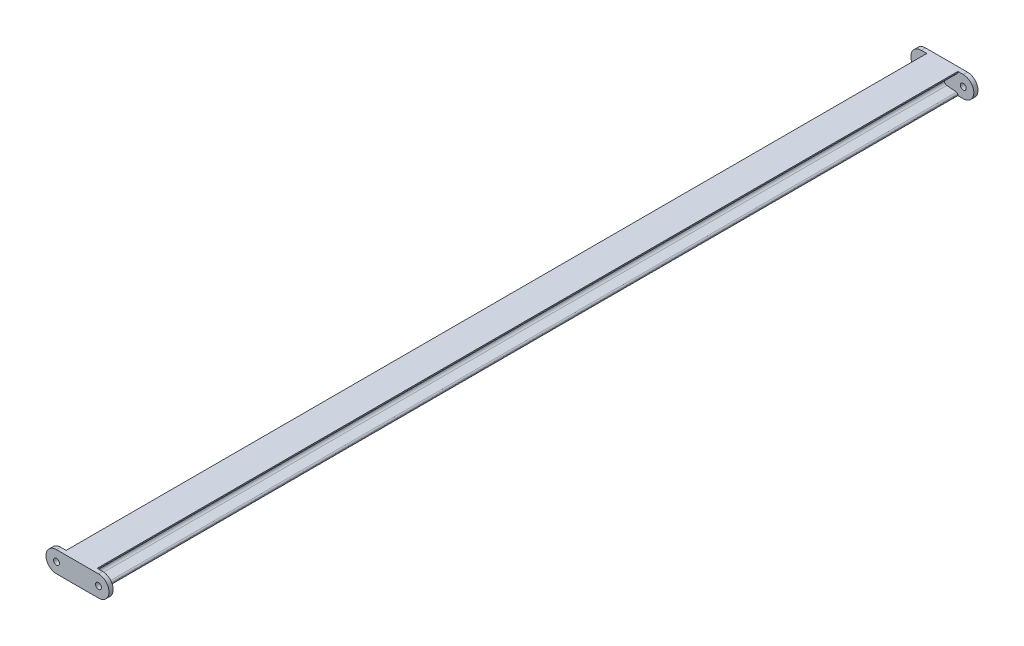
ISO-10303-21;
HEADER;
FILE_DESCRIPTION(('STEP AP214'),'2;1');
FILE_NAME('part.step','',(''),(''),'','','');
FILE_SCHEMA(('AUTOMOTIVE_DESIGN { 1 0 10303 214 1 1 1 1 }'));
ENDSEC;
DATA;
#1=APPLICATION_CONTEXT('core data for automotive mechanical design processes');
#2=APPLICATION_PROTOCOL_DEFINITION('international standard','automotive_design',2000,#1);
#3=PRODUCT_CONTEXT('',#1,'mechanical');
#4=PRODUCT('Part','Part','',(#3));
#5=PRODUCT_RELATED_PRODUCT_CATEGORY('part','',(#4));
#6=PRODUCT_DEFINITION_FORMATION('','',#4);
#7=PRODUCT_DEFINITION_CONTEXT('part definition',#1,'design');
#8=PRODUCT_DEFINITION('design','',#6,#7);
#9=PRODUCT_DEFINITION_SHAPE('','',#8);
#10=(LENGTH_UNIT() NAMED_UNIT(*) SI_UNIT(.MILLI.,.METRE.));
#11=(NAMED_UNIT(*) PLANE_ANGLE_UNIT() SI_UNIT($,.RADIAN.));
#12=(NAMED_UNIT(*) SI_UNIT($,.STERADIAN.) SOLID_ANGLE_UNIT());
#13=UNCERTAINTY_MEASURE_WITH_UNIT(LENGTH_MEASURE(1.E-05),#10,'distance_accuracy_value','');
#14=(GEOMETRIC_REPRESENTATION_CONTEXT(3) GLOBAL_UNCERTAINTY_ASSIGNED_CONTEXT((#13)) GLOBAL_UNIT_ASSIGNED_CONTEXT((#10,
#11,#12)) REPRESENTATION_CONTEXT('',''));
#15=CARTESIAN_POINT('',(0.,0.,0.));
#16=DIRECTION('',(0.,0.,1.));
#17=DIRECTION('',(1.,0.,0.));
#18=AXIS2_PLACEMENT_3D('',#15,#16,#17);
#19=CARTESIAN_POINT('',(49.9999999999998,0.,1025.));
#20=DIRECTION('',(0.,0.,1.));
#21=DIRECTION('',(1.,0.,0.));
#22=AXIS2_PLACEMENT_3D('',#19,#20,#21);
#23=PLANE('',#22);
#24=CARTESIAN_POINT('',(-49.9999999999998,0.,1025.));
#25=DIRECTION('',(0.,0.,1.));
#26=DIRECTION('',(1.,0.,0.));
#27=AXIS2_PLACEMENT_3D('',#24,#25,#26);
#28=CIRCLE('',#27,7.);
#29=CARTESIAN_POINT('',(-42.9999999999998,0.,1025.));
#30=VERTEX_POINT('',#29);
#31=EDGE_CURVE('E342',#30,#30,#28,.T.);
#32=ORIENTED_EDGE('',*,*,#31,.T.);
#33=EDGE_LOOP('',(#32));
#34=FACE_BOUND('',#33,.T.);
#35=DIRECTION('',(0.,1.,0.));
#36=VECTOR('',#35,1.);
#37=CARTESIAN_POINT('',(-37.0000000000004,-24.9999999999996,1025.));
#38=LINE('',#37,#36);
#39=CARTESIAN_POINT('',(-37.0000000000004,-25.0000000000003,1025.));
#40=VERTEX_POINT('',#39);
#41=CARTESIAN_POINT('',(-37.0000000000004,-22.792319515895,1025.));
#42=VERTEX_POINT('',#41);
#43=EDGE_CURVE('E345',#40,#42,#38,.T.);
#44=ORIENTED_EDGE('',*,*,#43,.F.);
#45=DIRECTION('',(-1.,0.,0.));
#46=VECTOR('',#45,1.);
#47=CARTESIAN_POINT('',(-4.44089209850063E-13,-25.,1025.));
#48=LINE('',#47,#46);
#49=CARTESIAN_POINT('',(-49.9999999999998,-25.0000000000004,1025.));
#50=VERTEX_POINT('',#49);
#51=EDGE_CURVE('E450',#40,#50,#48,.T.);
#52=ORIENTED_EDGE('',*,*,#51,.T.);
#53=CARTESIAN_POINT('',(-49.9999999999998,0.,1025.));
#54=DIRECTION('',(0.,0.,1.));
#55=DIRECTION('',(1.,0.,0.));
#56=AXIS2_PLACEMENT_3D('',#53,#54,#55);
#57=CIRCLE('',#56,25.0000000000004);
#58=CARTESIAN_POINT('',(-49.9999999999998,25.0000000000004,1025.));
#59=VERTEX_POINT('',#58);
#60=EDGE_CURVE('E436',#59,#50,#57,.T.);
#61=ORIENTED_EDGE('',*,*,#60,.F.);
#62=DIRECTION('',(1.,0.,0.));
#63=VECTOR('',#62,1.);
#64=CARTESIAN_POINT('',(0.,25.,1025.));
#65=LINE('',#64,#63);
#66=CARTESIAN_POINT('',(-36.9999999999999,24.9999999999997,1025.));
#67=VERTEX_POINT('',#66);
#68=EDGE_CURVE('E445',#59,#67,#65,.T.);
#69=ORIENTED_EDGE('',*,*,#68,.T.);
#70=DIRECTION('',(0.,1.,0.));
#71=VECTOR('',#70,1.);
#72=CARTESIAN_POINT('',(-36.9999999999999,22.7923195158958,1025.));
#73=LINE('',#72,#71);
#74=CARTESIAN_POINT('',(-36.9999999999999,22.7923195158958,1025.));
#75=VERTEX_POINT('',#74);
#76=EDGE_CURVE('E358',#75,#67,#73,.T.);
#77=ORIENTED_EDGE('',*,*,#76,.F.);
#78=CARTESIAN_POINT('',(-33.4999999999996,22.7923195158958,1025.));
#79=DIRECTION('',(0.,0.,-1.));
#80=DIRECTION('',(-1.,0.,0.));
#81=AXIS2_PLACEMENT_3D('',#78,#79,#80);
#82=CIRCLE('',#81,3.5);
#83=CARTESIAN_POINT('',(-33.8482269636629,19.3096857450582,1025.));
#84=VERTEX_POINT('',#83);
#85=EDGE_CURVE('E398',#84,#75,#82,.T.);
#86=ORIENTED_EDGE('',*,*,#85,.F.);
#87=DIRECTION('',(-0.995038220239298,0.0994934181893957,0.));
#88=VECTOR('',#87,1.);
#89=CARTESIAN_POINT('',(-10.8035460726743,17.0054586045401,1025.));
#90=LINE('',#89,#88);
#91=CARTESIAN_POINT('',(-10.8035460726743,17.0054586045401,1025.));
#92=VERTEX_POINT('',#91);
#93=EDGE_CURVE('E395',#92,#84,#90,.T.);
#94=ORIENTED_EDGE('',*,*,#93,.F.);
#95=CARTESIAN_POINT('',(-11.4999999999998,10.040191062865,1025.));
#96=DIRECTION('',(0.,0.,1.));
#97=DIRECTION('',(1.,0.,0.));
#98=AXIS2_PLACEMENT_3D('',#95,#96,#97);
#99=CIRCLE('',#98,7.);
#100=CARTESIAN_POINT('',(-4.49999999999973,10.040191062865,1025.));
#101=VERTEX_POINT('',#100);
#102=EDGE_CURVE('E392',#101,#92,#99,.T.);
#103=ORIENTED_EDGE('',*,*,#102,.F.);
#104=DIRECTION('',(0.,1.,0.));
#105=VECTOR('',#104,1.);
#106=CARTESIAN_POINT('',(-4.50000000000017,-10.0401910628648,1025.));
#107=LINE('',#106,#105);
#108=CARTESIAN_POINT('',(-4.50000000000017,-10.0401910628647,1025.));
#109=VERTEX_POINT('',#108);
#110=EDGE_CURVE('E389',#109,#101,#107,.T.);
#111=ORIENTED_EDGE('',*,*,#110,.F.);
#112=CARTESIAN_POINT('',(-11.5000000000003,-10.0401910628647,1025.));
#113=DIRECTION('',(0.,0.,1.));
#114=DIRECTION('',(1.,0.,0.));
#115=AXIS2_PLACEMENT_3D('',#112,#113,#114);
#116=CIRCLE('',#115,7.);
#117=CARTESIAN_POINT('',(-10.8035460726743,-17.0054586045399,1025.));
#118=VERTEX_POINT('',#117);
#119=EDGE_CURVE('E386',#118,#109,#116,.T.);
#120=ORIENTED_EDGE('',*,*,#119,.F.);
#121=DIRECTION('',(0.9950382202393,0.0994934181893747,0.));
#122=VECTOR('',#121,1.);
#123=CARTESIAN_POINT('',(-33.8482269636629,-19.3096857450575,1025.));
#124=LINE('',#123,#122);
#125=CARTESIAN_POINT('',(-33.8482269636629,-19.3096857450575,1025.));
#126=VERTEX_POINT('',#125);
#127=EDGE_CURVE('E132',#126,#118,#124,.T.);
#128=ORIENTED_EDGE('',*,*,#127,.F.);
#129=CARTESIAN_POINT('',(-33.5000000000001,-22.7923195158951,1025.));
#130=DIRECTION('',(0.,0.,-1.));
#131=DIRECTION('',(-1.,0.,0.));
#132=AXIS2_PLACEMENT_3D('',#129,#130,#131);
#133=CIRCLE('',#132,3.5);
#134=EDGE_CURVE('E127',#42,#126,#133,.T.);
#135=ORIENTED_EDGE('',*,*,#134,.F.);
#136=EDGE_LOOP('',(#44,#52,#61,#69,#77,#86,#94,#103,#111,#120,#128,#135));
#137=FACE_BOUND('',#136,.T.);
#138=ADVANCED_FACE('F112',(#34,#137),#23,.F.);
#139=CARTESIAN_POINT('',(0.,25.,-1025.));
#140=DIRECTION('',(0.,-1.,0.));
#141=DIRECTION('',(1.,0.,0.));
#142=AXIS2_PLACEMENT_3D('',#139,#140,#141);
#143=PLANE('',#142);
#144=DIRECTION('',(0.,0.,1.));
#145=VECTOR('',#144,1.);
#146=CARTESIAN_POINT('',(36.9999999999999,24.9999999999999,-1025.));
#147=LINE('',#146,#145);
#148=CARTESIAN_POINT('',(36.9999999999999,24.9999999999999,-1025.));
#149=VERTEX_POINT('',#148);
#150=CARTESIAN_POINT('',(36.9999999999999,25.0000000000003,1025.));
#151=VERTEX_POINT('',#150);
#152=EDGE_CURVE('E13',#149,#151,#147,.T.);
#153=ORIENTED_EDGE('',*,*,#152,.F.);
#154=DIRECTION('',(1.,0.,0.));
#155=VECTOR('',#154,1.);
#156=CARTESIAN_POINT('',(0.,25.,-1025.));
#157=LINE('',#156,#155);
#158=CARTESIAN_POINT('',(49.9999999999998,25.0000000000004,-1025.));
#159=VERTEX_POINT('',#158);
#160=EDGE_CURVE('E335',#149,#159,#157,.T.);
#161=ORIENTED_EDGE('',*,*,#160,.T.);
#162=DIRECTION('',(0.,0.,1.));
#163=VECTOR('',#162,1.);
#164=CARTESIAN_POINT('',(49.9999999999998,25.0000000000004,-1035.));
#165=LINE('',#164,#163);
#166=CARTESIAN_POINT('',(49.9999999999998,25.0000000000004,-1035.));
#167=VERTEX_POINT('',#166);
#168=EDGE_CURVE('E312',#167,#159,#165,.T.);
#169=ORIENTED_EDGE('',*,*,#168,.F.);
#170=DIRECTION('',(1.,0.,0.));
#171=VECTOR('',#170,1.);
#172=CARTESIAN_POINT('',(-49.9999999999998,25.0000000000004,-1035.));
#173=LINE('',#172,#171);
#174=CARTESIAN_POINT('',(-49.9999999999998,25.0000000000004,-1035.));
#175=VERTEX_POINT('',#174);
#176=EDGE_CURVE('E310',#175,#167,#173,.T.);
#177=ORIENTED_EDGE('',*,*,#176,.F.);
#178=DIRECTION('',(0.,0.,1.));
#179=VECTOR('',#178,1.);
#180=CARTESIAN_POINT('',(-49.9999999999998,25.0000000000004,-1035.));
#181=LINE('',#180,#179);
#182=CARTESIAN_POINT('',(-49.9999999999998,25.0000000000004,-1025.));
#183=VERTEX_POINT('',#182);
#184=EDGE_CURVE('E296',#175,#183,#181,.T.);
#185=ORIENTED_EDGE('',*,*,#184,.T.);
#186=CARTESIAN_POINT('',(-36.9999999999999,25.0000000000004,-1025.));
#187=VERTEX_POINT('',#186);
#188=EDGE_CURVE('E316',#183,#187,#157,.T.);
#189=ORIENTED_EDGE('',*,*,#188,.T.);
#190=DIRECTION('',(0.,0.,1.));
#191=VECTOR('',#190,1.);
#192=CARTESIAN_POINT('',(-36.9999999999999,25.0000000000004,-1025.));
#193=LINE('',#192,#191);
#194=EDGE_CURVE('E382',#187,#67,#193,.T.);
#195=ORIENTED_EDGE('',*,*,#194,.T.);
#196=ORIENTED_EDGE('',*,*,#68,.F.);
#197=DIRECTION('',(0.,0.,-1.));
#198=VECTOR('',#197,1.);
#199=CARTESIAN_POINT('',(-49.9999999999998,25.0000000000004,1035.));
#200=LINE('',#199,#198);
#201=CARTESIAN_POINT('',(-49.9999999999998,25.0000000000004,1035.));
#202=VERTEX_POINT('',#201);
#203=EDGE_CURVE('E455',#202,#59,#200,.T.);
#204=ORIENTED_EDGE('',*,*,#203,.F.);
#205=DIRECTION('',(1.,0.,0.));
#206=VECTOR('',#205,1.);
#207=CARTESIAN_POINT('',(-49.9999999999998,25.0000000000004,1035.));
#208=LINE('',#207,#206);
#209=CARTESIAN_POINT('',(49.9999999999998,25.0000000000004,1035.));
#210=VERTEX_POINT('',#209);
#211=EDGE_CURVE('E433',#202,#210,#208,.T.);
#212=ORIENTED_EDGE('',*,*,#211,.T.);
#213=DIRECTION('',(0.,0.,-1.));
#214=VECTOR('',#213,1.);
#215=CARTESIAN_POINT('',(49.9999999999998,25.0000000000004,1035.));
#216=LINE('',#215,#214);
#217=CARTESIAN_POINT('',(49.9999999999998,25.0000000000004,1025.));
#218=VERTEX_POINT('',#217);
#219=EDGE_CURVE('E444',#210,#218,#216,.T.);
#220=ORIENTED_EDGE('',*,*,#219,.T.);
#221=EDGE_CURVE('E432',#151,#218,#65,.T.);
#222=ORIENTED_EDGE('',*,*,#221,.F.);
#223=EDGE_LOOP('',(#153,#161,#169,#177,#185,#189,#195,#196,#204,#212,#220,#222));
#224=FACE_BOUND('',#223,.T.);
#225=ADVANCED_FACE('F114',(#224),#143,.F.);
#226=CARTESIAN_POINT('',(36.9999999999999,24.9999999999999,-1025.));
#227=DIRECTION('',(-1.,0.,0.));
#228=DIRECTION('',(0.,-1.,0.));
#229=AXIS2_PLACEMENT_3D('',#226,#227,#228);
#230=PLANE('',#229);
#231=DIRECTION('',(0.,-1.,0.));
#232=VECTOR('',#231,1.);
#233=CARTESIAN_POINT('',(36.9999999999999,24.9999999999999,1025.));
#234=LINE('',#233,#232);
#235=CARTESIAN_POINT('',(36.9999999999999,22.7923195158953,1025.));
#236=VERTEX_POINT('',#235);
#237=EDGE_CURVE('E458',#151,#236,#234,.T.);
#238=ORIENTED_EDGE('',*,*,#237,.T.);
#239=DIRECTION('',(0.,0.,1.));
#240=VECTOR('',#239,1.);
#241=CARTESIAN_POINT('',(36.9999999999999,22.7923195158953,-1025.));
#242=LINE('',#241,#240);
#243=CARTESIAN_POINT('',(36.9999999999999,22.7923195158953,-1025.));
#244=VERTEX_POINT('',#243);
#245=EDGE_CURVE('E120',#244,#236,#242,.T.);
#246=ORIENTED_EDGE('',*,*,#245,.F.);
#247=DIRECTION('',(0.,-1.,0.));
#248=VECTOR('',#247,1.);
#249=CARTESIAN_POINT('',(36.9999999999999,24.9999999999999,-1025.));
#250=LINE('',#249,#248);
#251=EDGE_CURVE('E467',#149,#244,#250,.T.);
#252=ORIENTED_EDGE('',*,*,#251,.F.);
#253=ORIENTED_EDGE('',*,*,#152,.T.);
#254=EDGE_LOOP('',(#238,#246,#252,#253));
#255=FACE_BOUND('',#254,.T.);
#256=ADVANCED_FACE('F549',(#255),#230,.F.);
#257=CARTESIAN_POINT('',(33.5000000000001,22.7923195158953,-1025.));
#258=DIRECTION('',(0.,0.,1.));
#259=DIRECTION('',(1.,0.,0.));
#260=AXIS2_PLACEMENT_3D('',#257,#258,#259);
#261=CYLINDRICAL_SURFACE('',#260,3.5);
#262=CARTESIAN_POINT('',(33.5000000000001,22.7923195158953,1025.));
#263=DIRECTION('',(0.,0.,-1.));
#264=DIRECTION('',(-1.,0.,0.));
#265=AXIS2_PLACEMENT_3D('',#262,#263,#264);
#266=CIRCLE('',#265,3.5);
#267=CARTESIAN_POINT('',(33.8482269636629,19.3096857450578,1025.));
#268=VERTEX_POINT('',#267);
#269=EDGE_CURVE('E498',#236,#268,#266,.T.);
#270=ORIENTED_EDGE('',*,*,#269,.T.);
#271=DIRECTION('',(0.,0.,1.));
#272=VECTOR('',#271,1.);
#273=CARTESIAN_POINT('',(33.8482269636629,19.3096857450578,-1025.));
#274=LINE('',#273,#272);
#275=CARTESIAN_POINT('',(33.8482269636629,19.3096857450578,-1025.));
#276=VERTEX_POINT('',#275);
#277=EDGE_CURVE('E541',#276,#268,#274,.T.);
#278=ORIENTED_EDGE('',*,*,#277,.F.);
#279=CARTESIAN_POINT('',(33.5000000000001,22.7923195158953,-1025.));
#280=DIRECTION('',(0.,0.,-1.));
#281=DIRECTION('',(-1.,0.,0.));
#282=AXIS2_PLACEMENT_3D('',#279,#280,#281);
#283=CIRCLE('',#282,3.5);
#284=EDGE_CURVE('E470',#244,#276,#283,.T.);
#285=ORIENTED_EDGE('',*,*,#284,.F.);
#286=ORIENTED_EDGE('',*,*,#245,.T.);
#287=EDGE_LOOP('',(#270,#278,#285,#286));
#288=FACE_BOUND('',#287,.T.);
#289=ADVANCED_FACE('F546',(#288),#261,.T.);
#290=CARTESIAN_POINT('',(33.8482269636629,19.3096857450578,-1025.));
#291=DIRECTION('',(-0.0994934181893816,0.995038220239299,0.));
#292=DIRECTION('',(-0.9950382202393,-0.0994934181893816,0.));
#293=AXIS2_PLACEMENT_3D('',#290,#291,#292);
#294=PLANE('',#293);
#295=DIRECTION('',(-0.9950382202393,-0.0994934181893816,0.));
#296=VECTOR('',#295,1.);
#297=CARTESIAN_POINT('',(33.8482269636629,19.3096857450578,1025.));
#298=LINE('',#297,#296);
#299=CARTESIAN_POINT('',(10.8035460726743,17.0054586045399,1025.));
#300=VERTEX_POINT('',#299);
#301=EDGE_CURVE('E501',#268,#300,#298,.T.);
#302=ORIENTED_EDGE('',*,*,#301,.T.);
#303=DIRECTION('',(0.,0.,1.));
#304=VECTOR('',#303,1.);
#305=CARTESIAN_POINT('',(10.8035460726743,17.0054586045399,-1025.));
#306=LINE('',#305,#304);
#307=CARTESIAN_POINT('',(10.8035460726743,17.0054586045399,-1025.));
#308=VERTEX_POINT('',#307);
#309=EDGE_CURVE('E538',#308,#300,#306,.T.);
#310=ORIENTED_EDGE('',*,*,#309,.F.);
#311=DIRECTION('',(-0.9950382202393,-0.0994934181893816,0.));
#312=VECTOR('',#311,1.);
#313=CARTESIAN_POINT('',(33.8482269636629,19.3096857450578,-1025.));
#314=LINE('',#313,#312);
#315=EDGE_CURVE('E474',#276,#308,#314,.T.);
#316=ORIENTED_EDGE('',*,*,#315,.F.);
#317=ORIENTED_EDGE('',*,*,#277,.T.);
#318=EDGE_LOOP('',(#302,#310,#316,#317));
#319=FACE_BOUND('',#318,.T.);
#320=ADVANCED_FACE('F903',(#319),#294,.F.);
#321=CARTESIAN_POINT('',(11.4999999999998,10.0401910628648,-1025.));
#322=DIRECTION('',(0.,0.,1.));
#323=DIRECTION('',(1.,0.,0.));
#324=AXIS2_PLACEMENT_3D('',#321,#322,#323);
#325=CYLINDRICAL_SURFACE('',#324,7.);
#326=CARTESIAN_POINT('',(11.4999999999998,10.0401910628648,1025.));
#327=DIRECTION('',(0.,0.,1.));
#328=DIRECTION('',(1.,0.,0.));
#329=AXIS2_PLACEMENT_3D('',#326,#327,#328);
#330=CIRCLE('',#329,7.);
#331=CARTESIAN_POINT('',(4.50000000000017,10.0401910628649,1025.));
#332=VERTEX_POINT('',#331);
#333=EDGE_CURVE('E504',#300,#332,#330,.T.);
#334=ORIENTED_EDGE('',*,*,#333,.T.);
#335=DIRECTION('',(0.,0.,1.));
#336=VECTOR('',#335,1.);
#337=CARTESIAN_POINT('',(4.50000000000017,10.0401910628649,-1025.));
#338=LINE('',#337,#336);
#339=CARTESIAN_POINT('',(4.50000000000017,10.0401910628649,-1025.));
#340=VERTEX_POINT('',#339);
#341=EDGE_CURVE('E535',#340,#332,#338,.T.);
#342=ORIENTED_EDGE('',*,*,#341,.F.);
#343=CARTESIAN_POINT('',(11.4999999999998,10.0401910628648,-1025.));
#344=DIRECTION('',(0.,0.,1.));
#345=DIRECTION('',(1.,0.,0.));
#346=AXIS2_PLACEMENT_3D('',#343,#344,#345);
#347=CIRCLE('',#346,7.);
#348=EDGE_CURVE('E477',#308,#340,#347,.T.);
#349=ORIENTED_EDGE('',*,*,#348,.F.);
#350=ORIENTED_EDGE('',*,*,#309,.T.);
#351=EDGE_LOOP('',(#334,#342,#349,#350));
#352=FACE_BOUND('',#351,.T.);
#353=ADVANCED_FACE('F892',(#352),#325,.F.);
#354=CARTESIAN_POINT('',(4.50000000000017,10.0401910628649,-1025.));
#355=DIRECTION('',(-1.,0.,0.));
#356=DIRECTION('',(0.,-1.,0.));
#357=AXIS2_PLACEMENT_3D('',#354,#355,#356);
#358=PLANE('',#357);
#359=DIRECTION('',(0.,-1.,0.));
#360=VECTOR('',#359,1.);
#361=CARTESIAN_POINT('',(4.50000000000017,10.0401910628649,1025.));
#362=LINE('',#361,#360);
#363=CARTESIAN_POINT('',(4.50000000000017,-10.0401910628649,1025.));
#364=VERTEX_POINT('',#363);
#365=EDGE_CURVE('E507',#332,#364,#362,.T.);
#366=ORIENTED_EDGE('',*,*,#365,.T.);
#367=DIRECTION('',(0.,0.,1.));
#368=VECTOR('',#367,1.);
#369=CARTESIAN_POINT('',(4.50000000000017,-10.0401910628649,-1025.));
#370=LINE('',#369,#368);
#371=CARTESIAN_POINT('',(4.50000000000017,-10.0401910628649,-1025.));
#372=VERTEX_POINT('',#371);
#373=EDGE_CURVE('E532',#372,#364,#370,.T.);
#374=ORIENTED_EDGE('',*,*,#373,.F.);
#375=DIRECTION('',(0.,-1.,0.));
#376=VECTOR('',#375,1.);
#377=CARTESIAN_POINT('',(4.50000000000017,10.0401910628649,-1025.));
#378=LINE('',#377,#376);
#379=EDGE_CURVE('E480',#340,#372,#378,.T.);
#380=ORIENTED_EDGE('',*,*,#379,.F.);
#381=ORIENTED_EDGE('',*,*,#341,.T.);
#382=EDGE_LOOP('',(#366,#374,#380,#381));
#383=FACE_BOUND('',#382,.T.);
#384=ADVANCED_FACE('F881',(#383),#358,.F.);
#385=CARTESIAN_POINT('',(11.4999999999998,-10.0401910628649,-1025.));
#386=DIRECTION('',(0.,0.,1.));
#387=DIRECTION('',(1.,0.,0.));
#388=AXIS2_PLACEMENT_3D('',#385,#386,#387);
#389=CYLINDRICAL_SURFACE('',#388,7.);
#390=CARTESIAN_POINT('',(11.4999999999998,-10.0401910628649,1025.));
#391=DIRECTION('',(0.,0.,1.));
#392=DIRECTION('',(1.,0.,0.));
#393=AXIS2_PLACEMENT_3D('',#390,#391,#392);
#394=CIRCLE('',#393,7.);
#395=CARTESIAN_POINT('',(10.8035460726743,-17.00545860454,1025.));
#396=VERTEX_POINT('',#395);
#397=EDGE_CURVE('E510',#364,#396,#394,.T.);
#398=ORIENTED_EDGE('',*,*,#397,.T.);
#399=DIRECTION('',(0.,0.,1.));
#400=VECTOR('',#399,1.);
#401=CARTESIAN_POINT('',(10.8035460726743,-17.00545860454,-1025.));
#402=LINE('',#401,#400);
#403=CARTESIAN_POINT('',(10.8035460726743,-17.00545860454,-1025.));
#404=VERTEX_POINT('',#403);
#405=EDGE_CURVE('E529',#404,#396,#402,.T.);
#406=ORIENTED_EDGE('',*,*,#405,.F.);
#407=CARTESIAN_POINT('',(11.4999999999998,-10.0401910628649,-1025.));
#408=DIRECTION('',(0.,0.,1.));
#409=DIRECTION('',(1.,0.,0.));
#410=AXIS2_PLACEMENT_3D('',#407,#408,#409);
#411=CIRCLE('',#410,7.);
#412=EDGE_CURVE('E483',#372,#404,#411,.T.);
#413=ORIENTED_EDGE('',*,*,#412,.F.);
#414=ORIENTED_EDGE('',*,*,#373,.T.);
#415=EDGE_LOOP('',(#398,#406,#413,#414));
#416=FACE_BOUND('',#415,.T.);
#417=ADVANCED_FACE('F870',(#416),#389,.F.);
#418=CARTESIAN_POINT('',(10.8035460726743,-17.00545860454,-1025.));
#419=DIRECTION('',(-0.0994934181893889,-0.995038220239299,0.));
#420=DIRECTION('',(0.995038220239299,-0.0994934181893889,0.));
#421=AXIS2_PLACEMENT_3D('',#418,#419,#420);
#422=PLANE('',#421);
#423=DIRECTION('',(0.995038220239299,-0.0994934181893889,0.));
#424=VECTOR('',#423,1.);
#425=CARTESIAN_POINT('',(10.8035460726743,-17.00545860454,1025.));
#426=LINE('',#425,#424);
#427=CARTESIAN_POINT('',(33.8482269636629,-19.309685745058,1025.));
#428=VERTEX_POINT('',#427);
#429=EDGE_CURVE('E513',#396,#428,#426,.T.);
#430=ORIENTED_EDGE('',*,*,#429,.T.);
#431=DIRECTION('',(0.,0.,1.));
#432=VECTOR('',#431,1.);
#433=CARTESIAN_POINT('',(33.8482269636629,-19.309685745058,-1025.));
#434=LINE('',#433,#432);
#435=CARTESIAN_POINT('',(33.8482269636629,-19.309685745058,-1025.));
#436=VERTEX_POINT('',#435);
#437=EDGE_CURVE('E526',#436,#428,#434,.T.);
#438=ORIENTED_EDGE('',*,*,#437,.F.);
#439=DIRECTION('',(0.995038220239299,-0.0994934181893889,0.));
#440=VECTOR('',#439,1.);
#441=CARTESIAN_POINT('',(10.8035460726743,-17.00545860454,-1025.));
#442=LINE('',#441,#440);
#443=EDGE_CURVE('E486',#404,#436,#442,.T.);
#444=ORIENTED_EDGE('',*,*,#443,.F.);
#445=ORIENTED_EDGE('',*,*,#405,.T.);
#446=EDGE_LOOP('',(#430,#438,#444,#445));
#447=FACE_BOUND('',#446,.T.);
#448=ADVANCED_FACE('F859',(#447),#422,.F.);
#449=CARTESIAN_POINT('',(33.5000000000001,-22.7923195158956,-1025.));
#450=DIRECTION('',(0.,0.,1.));
#451=DIRECTION('',(1.,0.,0.));
#452=AXIS2_PLACEMENT_3D('',#449,#450,#451);
#453=CYLINDRICAL_SURFACE('',#452,3.5);
#454=CARTESIAN_POINT('',(33.5000000000001,-22.7923195158956,1025.));
#455=DIRECTION('',(0.,0.,-1.));
#456=DIRECTION('',(-1.,0.,0.));
#457=AXIS2_PLACEMENT_3D('',#454,#455,#456);
#458=CIRCLE('',#457,3.5);
#459=CARTESIAN_POINT('',(36.9999999999999,-22.7923195158956,1025.));
#460=VERTEX_POINT('',#459);
#461=EDGE_CURVE('E516',#428,#460,#458,.T.);
#462=ORIENTED_EDGE('',*,*,#461,.T.);
#463=DIRECTION('',(0.,0.,1.));
#464=VECTOR('',#463,1.);
#465=CARTESIAN_POINT('',(36.9999999999999,-22.7923195158956,-1025.));
#466=LINE('',#465,#464);
#467=CARTESIAN_POINT('',(36.9999999999999,-22.7923195158956,-1025.));
#468=VERTEX_POINT('',#467);
#469=EDGE_CURVE('E523',#468,#460,#466,.T.);
#470=ORIENTED_EDGE('',*,*,#469,.F.);
#471=CARTESIAN_POINT('',(33.5000000000001,-22.7923195158956,-1025.));
#472=DIRECTION('',(0.,0.,-1.));
#473=DIRECTION('',(-1.,0.,0.));
#474=AXIS2_PLACEMENT_3D('',#471,#472,#473);
#475=CIRCLE('',#474,3.5);
#476=EDGE_CURVE('E489',#436,#468,#475,.T.);
#477=ORIENTED_EDGE('',*,*,#476,.F.);
#478=ORIENTED_EDGE('',*,*,#437,.T.);
#479=EDGE_LOOP('',(#462,#470,#477,#478));
#480=FACE_BOUND('',#479,.T.);
#481=ADVANCED_FACE('F849',(#480),#453,.T.);
#482=CARTESIAN_POINT('',(36.9999999999999,-22.7923195158956,-1025.));
#483=DIRECTION('',(-1.,0.,0.));
#484=DIRECTION('',(0.,-1.,0.));
#485=AXIS2_PLACEMENT_3D('',#482,#483,#484);
#486=PLANE('',#485);
#487=DIRECTION('',(0.,-1.,0.));
#488=VECTOR('',#487,1.);
#489=CARTESIAN_POINT('',(36.9999999999999,-22.7923195158956,1025.));
#490=LINE('',#489,#488);
#491=CARTESIAN_POINT('',(36.9999999999999,-24.9999999999997,1025.));
#492=VERTEX_POINT('',#491);
#493=EDGE_CURVE('E471',#460,#492,#490,.T.);
#494=ORIENTED_EDGE('',*,*,#493,.T.);
#495=DIRECTION('',(0.,0.,1.));
#496=VECTOR('',#495,1.);
#497=CARTESIAN_POINT('',(36.9999999999999,-25.0000000000002,-1025.));
#498=LINE('',#497,#496);
#499=CARTESIAN_POINT('',(36.9999999999999,-25.0000000000003,-1025.));
#500=VERTEX_POINT('',#499);
#501=EDGE_CURVE('E495',#500,#492,#498,.T.);
#502=ORIENTED_EDGE('',*,*,#501,.F.);
#503=DIRECTION('',(0.,-1.,0.));
#504=VECTOR('',#503,1.);
#505=CARTESIAN_POINT('',(36.9999999999999,-22.7923195158956,-1025.));
#506=LINE('',#505,#504);
#507=EDGE_CURVE('E492',#468,#500,#506,.T.);
#508=ORIENTED_EDGE('',*,*,#507,.F.);
#509=ORIENTED_EDGE('',*,*,#469,.T.);
#510=EDGE_LOOP('',(#494,#502,#508,#509));
#511=FACE_BOUND('',#510,.T.);
#512=ADVANCED_FACE('F562',(#511),#486,.F.);
#513=CARTESIAN_POINT('',(36.9999999999999,-25.0000000000002,-1025.));
#514=DIRECTION('',(0.,1.,0.));
#515=DIRECTION('',(-1.,0.,0.));
#516=AXIS2_PLACEMENT_3D('',#513,#514,#515);
#517=PLANE('',#516);
#518=ORIENTED_EDGE('',*,*,#501,.T.);
#519=CARTESIAN_POINT('',(49.9999999999998,-25.0000000000004,1025.));
#520=VERTEX_POINT('',#519);
#521=EDGE_CURVE('E451',#520,#492,#48,.T.);
#522=ORIENTED_EDGE('',*,*,#521,.F.);
#523=DIRECTION('',(0.,0.,-1.));
#524=VECTOR('',#523,1.);
#525=CARTESIAN_POINT('',(49.9999999999998,-25.0000000000004,1035.));
#526=LINE('',#525,#524);
#527=CARTESIAN_POINT('',(49.9999999999998,-25.0000000000004,1035.));
#528=VERTEX_POINT('',#527);
#529=EDGE_CURVE('E462',#528,#520,#526,.T.);
#530=ORIENTED_EDGE('',*,*,#529,.F.);
#531=DIRECTION('',(-1.,0.,0.));
#532=VECTOR('',#531,1.);
#533=CARTESIAN_POINT('',(49.9999999999998,-25.0000000000004,1035.));
#534=LINE('',#533,#532);
#535=CARTESIAN_POINT('',(-49.9999999999998,-25.0000000000004,1035.));
#536=VERTEX_POINT('',#535);
#537=EDGE_CURVE('E439',#528,#536,#534,.T.);
#538=ORIENTED_EDGE('',*,*,#537,.T.);
#539=DIRECTION('',(0.,0.,-1.));
#540=VECTOR('',#539,1.);
#541=CARTESIAN_POINT('',(-49.9999999999998,-25.0000000000004,1035.));
#542=LINE('',#541,#540);
#543=EDGE_CURVE('E459',#536,#50,#542,.T.);
#544=ORIENTED_EDGE('',*,*,#543,.T.);
#545=ORIENTED_EDGE('',*,*,#51,.F.);
#546=DIRECTION('',(0.,0.,1.));
#547=VECTOR('',#546,1.);
#548=CARTESIAN_POINT('',(-37.0000000000004,-24.9999999999996,-1025.));
#549=LINE('',#548,#547);
#550=CARTESIAN_POINT('',(-37.0000000000004,-24.9999999999996,-1025.));
#551=VERTEX_POINT('',#550);
#552=EDGE_CURVE('E429',#551,#40,#549,.T.);
#553=ORIENTED_EDGE('',*,*,#552,.F.);
#554=DIRECTION('',(-1.,0.,0.));
#555=VECTOR('',#554,1.);
#556=CARTESIAN_POINT('',(49.9999999999998,-25.0000000000004,-1025.));
#557=LINE('',#556,#555);
#558=CARTESIAN_POINT('',(-49.9999999999998,-25.0000000000004,-1025.));
#559=VERTEX_POINT('',#558);
#560=EDGE_CURVE('E327',#551,#559,#557,.T.);
#561=ORIENTED_EDGE('',*,*,#560,.T.);
#562=DIRECTION('',(0.,0.,1.));
#563=VECTOR('',#562,1.);
#564=CARTESIAN_POINT('',(-49.9999999999998,-25.0000000000004,-1035.));
#565=LINE('',#564,#563);
#566=CARTESIAN_POINT('',(-49.9999999999998,-25.0000000000004,-1035.));
#567=VERTEX_POINT('',#566);
#568=EDGE_CURVE('E306',#567,#559,#565,.T.);
#569=ORIENTED_EDGE('',*,*,#568,.F.);
#570=DIRECTION('',(-1.,0.,0.));
#571=VECTOR('',#570,1.);
#572=CARTESIAN_POINT('',(-4.44089209850063E-13,-25.,-1035.));
#573=LINE('',#572,#571);
#574=CARTESIAN_POINT('',(49.9999999999998,-25.0000000000004,-1035.));
#575=VERTEX_POINT('',#574);
#576=EDGE_CURVE('E319',#575,#567,#573,.T.);
#577=ORIENTED_EDGE('',*,*,#576,.F.);
#578=DIRECTION('',(0.,0.,1.));
#579=VECTOR('',#578,1.);
#580=CARTESIAN_POINT('',(49.9999999999998,-25.0000000000004,-1035.));
#581=LINE('',#580,#579);
#582=CARTESIAN_POINT('',(49.9999999999998,-25.0000000000004,-1025.));
#583=VERTEX_POINT('',#582);
#584=EDGE_CURVE('E339',#575,#583,#581,.T.);
#585=ORIENTED_EDGE('',*,*,#584,.T.);
#586=EDGE_CURVE('E329',#583,#500,#557,.T.);
#587=ORIENTED_EDGE('',*,*,#586,.T.);
#588=EDGE_LOOP('',(#518,#522,#530,#538,#544,#545,#553,#561,#569,#577,#585,#587));
#589=FACE_BOUND('',#588,.T.);
#590=ADVANCED_FACE('F564',(#589),#517,.F.);
#591=CARTESIAN_POINT('',(-49.9999999999998,0.,1035.));
#592=DIRECTION('',(0.,0.,-1.));
#593=DIRECTION('',(-1.,0.,0.));
#594=AXIS2_PLACEMENT_3D('',#591,#592,#593);
#595=CYLINDRICAL_SURFACE('',#594,25.0000000000004);
#596=ORIENTED_EDGE('',*,*,#60,.T.);
#597=ORIENTED_EDGE('',*,*,#543,.F.);
#598=CARTESIAN_POINT('',(-49.9999999999998,0.,1035.));
#599=DIRECTION('',(0.,0.,1.));
#600=DIRECTION('',(1.,0.,0.));
#601=AXIS2_PLACEMENT_3D('',#598,#599,#600);
#602=CIRCLE('',#601,25.0000000000004);
#603=EDGE_CURVE('E441',#202,#536,#602,.T.);
#604=ORIENTED_EDGE('',*,*,#603,.F.);
#605=ORIENTED_EDGE('',*,*,#203,.T.);
#606=EDGE_LOOP('',(#596,#597,#604,#605));
#607=FACE_BOUND('',#606,.T.);
#608=ADVANCED_FACE('F619',(#607),#595,.T.);
#609=CARTESIAN_POINT('',(49.9999999999998,0.,1035.));
#610=DIRECTION('',(0.,0.,-1.));
#611=DIRECTION('',(-1.,0.,0.));
#612=AXIS2_PLACEMENT_3D('',#609,#610,#611);
#613=CYLINDRICAL_SURFACE('',#612,25.0000000000004);
#614=CARTESIAN_POINT('',(49.9999999999998,0.,1025.));
#615=DIRECTION('',(0.,0.,1.));
#616=DIRECTION('',(1.,0.,0.));
#617=AXIS2_PLACEMENT_3D('',#614,#615,#616);
#618=CIRCLE('',#617,25.0000000000004);
#619=EDGE_CURVE('E447',#520,#218,#618,.T.);
#620=ORIENTED_EDGE('',*,*,#619,.T.);
#621=ORIENTED_EDGE('',*,*,#219,.F.);
#622=CARTESIAN_POINT('',(49.9999999999998,0.,1035.));
#623=DIRECTION('',(0.,0.,1.));
#624=DIRECTION('',(1.,0.,0.));
#625=AXIS2_PLACEMENT_3D('',#622,#623,#624);
#626=CIRCLE('',#625,25.0000000000004);
#627=EDGE_CURVE('E435',#528,#210,#626,.T.);
#628=ORIENTED_EDGE('',*,*,#627,.F.);
#629=ORIENTED_EDGE('',*,*,#529,.T.);
#630=EDGE_LOOP('',(#620,#621,#628,#629));
#631=FACE_BOUND('',#630,.T.);
#632=ADVANCED_FACE('F559',(#631),#613,.T.);
#633=CARTESIAN_POINT('',(49.9999999999998,0.,1035.));
#634=DIRECTION('',(0.,0.,1.));
#635=DIRECTION('',(1.,0.,0.));
#636=AXIS2_PLACEMENT_3D('',#633,#634,#635);
#637=PLANE('',#636);
#638=CARTESIAN_POINT('',(-49.9999999999998,0.,1035.));
#639=DIRECTION('',(0.,0.,1.));
#640=DIRECTION('',(1.,0.,0.));
#641=AXIS2_PLACEMENT_3D('',#638,#639,#640);
#642=CIRCLE('',#641,7.);
#643=CARTESIAN_POINT('',(-42.9999999999998,0.,1035.));
#644=VERTEX_POINT('',#643);
#645=EDGE_CURVE('E346',#644,#644,#642,.T.);
#646=ORIENTED_EDGE('',*,*,#645,.F.);
#647=EDGE_LOOP('',(#646));
#648=FACE_BOUND('',#647,.T.);
#649=CARTESIAN_POINT('',(49.9999999999998,0.,1035.));
#650=DIRECTION('',(0.,0.,1.));
#651=DIRECTION('',(1.,0.,0.));
#652=AXIS2_PLACEMENT_3D('',#649,#650,#651);
#653=CIRCLE('',#652,7.);
#654=CARTESIAN_POINT('',(56.9999999999998,0.,1035.));
#655=VERTEX_POINT('',#654);
#656=EDGE_CURVE('E338',#655,#655,#653,.T.);
#657=ORIENTED_EDGE('',*,*,#656,.F.);
#658=EDGE_LOOP('',(#657));
#659=FACE_BOUND('',#658,.T.);
#660=ORIENTED_EDGE('',*,*,#211,.F.);
#661=ORIENTED_EDGE('',*,*,#603,.T.);
#662=ORIENTED_EDGE('',*,*,#537,.F.);
#663=ORIENTED_EDGE('',*,*,#627,.T.);
#664=EDGE_LOOP('',(#660,#661,#662,#663));
#665=FACE_BOUND('',#664,.T.);
#666=ADVANCED_FACE('F592',(#648,#659,#665),#637,.T.);
#667=CARTESIAN_POINT('',(49.9999999999998,0.,1025.));
#668=DIRECTION('',(0.,0.,1.));
#669=DIRECTION('',(1.,0.,0.));
#670=AXIS2_PLACEMENT_3D('',#667,#668,#669);
#671=CIRCLE('',#670,7.);
#672=CARTESIAN_POINT('',(56.9999999999998,0.,1025.));
#673=VERTEX_POINT('',#672);
#674=EDGE_CURVE('E349',#673,#673,#671,.T.);
#675=ORIENTED_EDGE('',*,*,#674,.T.);
#676=EDGE_LOOP('',(#675));
#677=FACE_BOUND('',#676,.T.);
#678=ORIENTED_EDGE('',*,*,#493,.F.);
#679=ORIENTED_EDGE('',*,*,#461,.F.);
#680=ORIENTED_EDGE('',*,*,#429,.F.);
#681=ORIENTED_EDGE('',*,*,#397,.F.);
#682=ORIENTED_EDGE('',*,*,#365,.F.);
#683=ORIENTED_EDGE('',*,*,#333,.F.);
#684=ORIENTED_EDGE('',*,*,#301,.F.);
#685=ORIENTED_EDGE('',*,*,#269,.F.);
#686=ORIENTED_EDGE('',*,*,#237,.F.);
#687=ORIENTED_EDGE('',*,*,#221,.T.);
#688=ORIENTED_EDGE('',*,*,#619,.F.);
#689=ORIENTED_EDGE('',*,*,#521,.T.);
#690=EDGE_LOOP('',(#678,#679,#680,#681,#682,#683,#684,#685,#686,#687,#688,#689));
#691=FACE_BOUND('',#690,.T.);
#692=ADVANCED_FACE('F553',(#677,#691),#23,.F.);
#693=CARTESIAN_POINT('',(-37.0000000000004,-24.9999999999996,-1025.));
#694=DIRECTION('',(1.,0.,0.));
#695=DIRECTION('',(0.,1.,0.));
#696=AXIS2_PLACEMENT_3D('',#693,#694,#695);
#697=PLANE('',#696);
#698=ORIENTED_EDGE('',*,*,#43,.T.);
#699=DIRECTION('',(0.,0.,1.));
#700=VECTOR('',#699,1.);
#701=CARTESIAN_POINT('',(-37.0000000000004,-22.792319515895,-1025.));
#702=LINE('',#701,#700);
#703=CARTESIAN_POINT('',(-37.0000000000004,-22.792319515895,-1025.));
#704=VERTEX_POINT('',#703);
#705=EDGE_CURVE('E426',#704,#42,#702,.T.);
#706=ORIENTED_EDGE('',*,*,#705,.F.);
#707=DIRECTION('',(0.,1.,0.));
#708=VECTOR('',#707,1.);
#709=CARTESIAN_POINT('',(-37.0000000000004,-24.9999999999996,-1025.));
#710=LINE('',#709,#708);
#711=EDGE_CURVE('E354',#551,#704,#710,.T.);
#712=ORIENTED_EDGE('',*,*,#711,.F.);
#713=ORIENTED_EDGE('',*,*,#552,.T.);
#714=EDGE_LOOP('',(#698,#706,#712,#713));
#715=FACE_BOUND('',#714,.T.);
#716=ADVANCED_FACE('F591',(#715),#697,.F.);
#717=CARTESIAN_POINT('',(-33.5000000000001,-22.7923195158951,-1025.));
#718=DIRECTION('',(0.,0.,1.));
#719=DIRECTION('',(1.,0.,0.));
#720=AXIS2_PLACEMENT_3D('',#717,#718,#719);
#721=CYLINDRICAL_SURFACE('',#720,3.5);
#722=ORIENTED_EDGE('',*,*,#134,.T.);
#723=DIRECTION('',(0.,0.,1.));
#724=VECTOR('',#723,1.);
#725=CARTESIAN_POINT('',(-33.8482269636629,-19.3096857450575,-1025.));
#726=LINE('',#725,#724);
#727=CARTESIAN_POINT('',(-33.8482269636629,-19.3096857450575,-1025.));
#728=VERTEX_POINT('',#727);
#729=EDGE_CURVE('E423',#728,#126,#726,.T.);
#730=ORIENTED_EDGE('',*,*,#729,.F.);
#731=CARTESIAN_POINT('',(-33.5000000000001,-22.7923195158951,-1025.));
#732=DIRECTION('',(0.,0.,-1.));
#733=DIRECTION('',(-1.,0.,0.));
#734=AXIS2_PLACEMENT_3D('',#731,#732,#733);
#735=CIRCLE('',#734,3.5);
#736=EDGE_CURVE('E357',#704,#728,#735,.T.);
#737=ORIENTED_EDGE('',*,*,#736,.F.);
#738=ORIENTED_EDGE('',*,*,#705,.T.);
#739=EDGE_LOOP('',(#722,#730,#737,#738));
#740=FACE_BOUND('',#739,.T.);
#741=ADVANCED_FACE('F598',(#740),#721,.T.);
#742=CARTESIAN_POINT('',(-33.8482269636629,-19.3096857450575,-1025.));
#743=DIRECTION('',(0.0994934181893747,-0.9950382202393,0.));
#744=DIRECTION('',(0.9950382202393,0.0994934181893747,0.));
#745=AXIS2_PLACEMENT_3D('',#742,#743,#744);
#746=PLANE('',#745);
#747=ORIENTED_EDGE('',*,*,#127,.T.);
#748=DIRECTION('',(0.,0.,1.));
#749=VECTOR('',#748,1.);
#750=CARTESIAN_POINT('',(-10.8035460726743,-17.0054586045399,-1025.));
#751=LINE('',#750,#749);
#752=CARTESIAN_POINT('',(-10.8035460726743,-17.0054586045399,-1025.));
#753=VERTEX_POINT('',#752);
#754=EDGE_CURVE('E420',#753,#118,#751,.T.);
#755=ORIENTED_EDGE('',*,*,#754,.F.);
#756=DIRECTION('',(0.9950382202393,0.0994934181893747,0.));
#757=VECTOR('',#756,1.);
#758=CARTESIAN_POINT('',(-33.8482269636629,-19.3096857450575,-1025.));
#759=LINE('',#758,#757);
#760=EDGE_CURVE('E361',#728,#753,#759,.T.);
#761=ORIENTED_EDGE('',*,*,#760,.F.);
#762=ORIENTED_EDGE('',*,*,#729,.T.);
#763=EDGE_LOOP('',(#747,#755,#761,#762));
#764=FACE_BOUND('',#763,.T.);
#765=ADVANCED_FACE('F644',(#764),#746,.F.);
#766=CARTESIAN_POINT('',(-11.5000000000003,-10.0401910628647,-1025.));
#767=DIRECTION('',(0.,0.,1.));
#768=DIRECTION('',(1.,0.,0.));
#769=AXIS2_PLACEMENT_3D('',#766,#767,#768);
#770=CYLINDRICAL_SURFACE('',#769,7.);
#771=ORIENTED_EDGE('',*,*,#119,.T.);
#772=DIRECTION('',(0.,0.,1.));
#773=VECTOR('',#772,1.);
#774=CARTESIAN_POINT('',(-4.50000000000017,-10.0401910628647,-1025.));
#775=LINE('',#774,#773);
#776=CARTESIAN_POINT('',(-4.50000000000017,-10.0401910628647,-1025.));
#777=VERTEX_POINT('',#776);
#778=EDGE_CURVE('E417',#777,#109,#775,.T.);
#779=ORIENTED_EDGE('',*,*,#778,.F.);
#780=CARTESIAN_POINT('',(-11.5000000000003,-10.0401910628647,-1025.));
#781=DIRECTION('',(0.,0.,1.));
#782=DIRECTION('',(1.,0.,0.));
#783=AXIS2_PLACEMENT_3D('',#780,#781,#782);
#784=CIRCLE('',#783,7.);
#785=EDGE_CURVE('E364',#753,#777,#784,.T.);
#786=ORIENTED_EDGE('',*,*,#785,.F.);
#787=ORIENTED_EDGE('',*,*,#754,.T.);
#788=EDGE_LOOP('',(#771,#779,#786,#787));
#789=FACE_BOUND('',#788,.T.);
#790=ADVANCED_FACE('F641',(#789),#770,.F.);
#791=CARTESIAN_POINT('',(-4.50000000000017,-10.0401910628648,-1025.));
#792=DIRECTION('',(1.,0.,0.));
#793=DIRECTION('',(0.,1.,0.));
#794=AXIS2_PLACEMENT_3D('',#791,#792,#793);
#795=PLANE('',#794);
#796=ORIENTED_EDGE('',*,*,#110,.T.);
#797=DIRECTION('',(0.,0.,1.));
#798=VECTOR('',#797,1.);
#799=CARTESIAN_POINT('',(-4.49999999999973,10.0401910628649,-1025.));
#800=LINE('',#799,#798);
#801=CARTESIAN_POINT('',(-4.49999999999973,10.0401910628649,-1025.));
#802=VERTEX_POINT('',#801);
#803=EDGE_CURVE('E414',#802,#101,#800,.T.);
#804=ORIENTED_EDGE('',*,*,#803,.F.);
#805=DIRECTION('',(0.,1.,0.));
#806=VECTOR('',#805,1.);
#807=CARTESIAN_POINT('',(-4.50000000000017,-10.0401910628648,-1025.));
#808=LINE('',#807,#806);
#809=EDGE_CURVE('E367',#777,#802,#808,.T.);
#810=ORIENTED_EDGE('',*,*,#809,.F.);
#811=ORIENTED_EDGE('',*,*,#778,.T.);
#812=EDGE_LOOP('',(#796,#804,#810,#811));
#813=FACE_BOUND('',#812,.T.);
#814=ADVANCED_FACE('F639',(#813),#795,.F.);
#815=CARTESIAN_POINT('',(-11.4999999999998,10.040191062865,-1025.));
#816=DIRECTION('',(0.,0.,1.));
#817=DIRECTION('',(1.,0.,0.));
#818=AXIS2_PLACEMENT_3D('',#815,#816,#817);
#819=CYLINDRICAL_SURFACE('',#818,7.);
#820=ORIENTED_EDGE('',*,*,#102,.T.);
#821=DIRECTION('',(0.,0.,1.));
#822=VECTOR('',#821,1.);
#823=CARTESIAN_POINT('',(-10.8035460726743,17.0054586045401,-1025.));
#824=LINE('',#823,#822);
#825=CARTESIAN_POINT('',(-10.8035460726743,17.0054586045401,-1025.));
#826=VERTEX_POINT('',#825);
#827=EDGE_CURVE('E411',#826,#92,#824,.T.);
#828=ORIENTED_EDGE('',*,*,#827,.F.);
#829=CARTESIAN_POINT('',(-11.4999999999998,10.040191062865,-1025.));
#830=DIRECTION('',(0.,0.,1.));
#831=DIRECTION('',(1.,0.,0.));
#832=AXIS2_PLACEMENT_3D('',#829,#830,#831);
#833=CIRCLE('',#832,7.);
#834=EDGE_CURVE('E370',#802,#826,#833,.T.);
#835=ORIENTED_EDGE('',*,*,#834,.F.);
#836=ORIENTED_EDGE('',*,*,#803,.T.);
#837=EDGE_LOOP('',(#820,#828,#835,#836));
#838=FACE_BOUND('',#837,.T.);
#839=ADVANCED_FACE('F635',(#838),#819,.F.);
#840=CARTESIAN_POINT('',(-10.8035460726743,17.0054586045401,-1025.));
#841=DIRECTION('',(0.0994934181893957,0.995038220239298,0.));
#842=DIRECTION('',(-0.995038220239298,0.0994934181893957,0.));
#843=AXIS2_PLACEMENT_3D('',#840,#841,#842);
#844=PLANE('',#843);
#845=ORIENTED_EDGE('',*,*,#93,.T.);
#846=DIRECTION('',(0.,0.,1.));
#847=VECTOR('',#846,1.);
#848=CARTESIAN_POINT('',(-33.8482269636629,19.3096857450582,-1025.));
#849=LINE('',#848,#847);
#850=CARTESIAN_POINT('',(-33.8482269636629,19.3096857450582,-1025.));
#851=VERTEX_POINT('',#850);
#852=EDGE_CURVE('E408',#851,#84,#849,.T.);
#853=ORIENTED_EDGE('',*,*,#852,.F.);
#854=DIRECTION('',(-0.995038220239298,0.0994934181893957,0.));
#855=VECTOR('',#854,1.);
#856=CARTESIAN_POINT('',(-10.8035460726743,17.0054586045401,-1025.));
#857=LINE('',#856,#855);
#858=EDGE_CURVE('E373',#826,#851,#857,.T.);
#859=ORIENTED_EDGE('',*,*,#858,.F.);
#860=ORIENTED_EDGE('',*,*,#827,.T.);
#861=EDGE_LOOP('',(#845,#853,#859,#860));
#862=FACE_BOUND('',#861,.T.);
#863=ADVANCED_FACE('F633',(#862),#844,.F.);
#864=CARTESIAN_POINT('',(-33.4999999999996,22.7923195158958,-1025.));
#865=DIRECTION('',(0.,0.,1.));
#866=DIRECTION('',(1.,0.,0.));
#867=AXIS2_PLACEMENT_3D('',#864,#865,#866);
#868=CYLINDRICAL_SURFACE('',#867,3.5);
#869=ORIENTED_EDGE('',*,*,#85,.T.);
#870=DIRECTION('',(0.,0.,1.));
#871=VECTOR('',#870,1.);
#872=CARTESIAN_POINT('',(-36.9999999999999,22.7923195158958,-1025.));
#873=LINE('',#872,#871);
#874=CARTESIAN_POINT('',(-36.9999999999999,22.7923195158958,-1025.));
#875=VERTEX_POINT('',#874);
#876=EDGE_CURVE('E405',#875,#75,#873,.T.);
#877=ORIENTED_EDGE('',*,*,#876,.F.);
#878=CARTESIAN_POINT('',(-33.4999999999996,22.7923195158958,-1025.));
#879=DIRECTION('',(0.,0.,-1.));
#880=DIRECTION('',(-1.,0.,0.));
#881=AXIS2_PLACEMENT_3D('',#878,#879,#880);
#882=CIRCLE('',#881,3.5);
#883=EDGE_CURVE('E376',#851,#875,#882,.T.);
#884=ORIENTED_EDGE('',*,*,#883,.F.);
#885=ORIENTED_EDGE('',*,*,#852,.T.);
#886=EDGE_LOOP('',(#869,#877,#884,#885));
#887=FACE_BOUND('',#886,.T.);
#888=ADVANCED_FACE('F629',(#887),#868,.T.);
#889=CARTESIAN_POINT('',(-36.9999999999999,22.7923195158958,-1025.));
#890=DIRECTION('',(1.,0.,0.));
#891=DIRECTION('',(0.,1.,0.));
#892=AXIS2_PLACEMENT_3D('',#889,#890,#891);
#893=PLANE('',#892);
#894=ORIENTED_EDGE('',*,*,#76,.T.);
#895=ORIENTED_EDGE('',*,*,#194,.F.);
#896=DIRECTION('',(0.,1.,0.));
#897=VECTOR('',#896,1.);
#898=CARTESIAN_POINT('',(-36.9999999999999,22.7923195158958,-1025.));
#899=LINE('',#898,#897);
#900=EDGE_CURVE('E379',#875,#187,#899,.T.);
#901=ORIENTED_EDGE('',*,*,#900,.F.);
#902=ORIENTED_EDGE('',*,*,#876,.T.);
#903=EDGE_LOOP('',(#894,#895,#901,#902));
#904=FACE_BOUND('',#903,.T.);
#905=ADVANCED_FACE('F608',(#904),#893,.F.);
#906=CARTESIAN_POINT('',(49.9999999999998,0.,1025.));
#907=DIRECTION('',(0.,0.,1.));
#908=DIRECTION('',(1.,0.,0.));
#909=AXIS2_PLACEMENT_3D('',#906,#907,#908);
#910=CYLINDRICAL_SURFACE('',#909,7.);
#911=ORIENTED_EDGE('',*,*,#674,.F.);
#912=EDGE_LOOP('',(#911));
#913=FACE_BOUND('',#912,.T.);
#914=ORIENTED_EDGE('',*,*,#656,.T.);
#915=EDGE_LOOP('',(#914));
#916=FACE_BOUND('',#915,.T.);
#917=ADVANCED_FACE('F604',(#913,#916),#910,.F.);
#918=CARTESIAN_POINT('',(-49.9999999999998,0.,1025.));
#919=DIRECTION('',(0.,0.,1.));
#920=DIRECTION('',(1.,0.,0.));
#921=AXIS2_PLACEMENT_3D('',#918,#919,#920);
#922=CYLINDRICAL_SURFACE('',#921,7.);
#923=ORIENTED_EDGE('',*,*,#31,.F.);
#924=EDGE_LOOP('',(#923));
#925=FACE_BOUND('',#924,.T.);
#926=ORIENTED_EDGE('',*,*,#645,.T.);
#927=EDGE_LOOP('',(#926));
#928=FACE_BOUND('',#927,.T.);
#929=ADVANCED_FACE('F607',(#925,#928),#922,.F.);
#930=CARTESIAN_POINT('',(49.9999999999998,0.,-1025.));
#931=DIRECTION('',(0.,0.,-1.));
#932=DIRECTION('',(1.,0.,0.));
#933=AXIS2_PLACEMENT_3D('',#930,#931,#932);
#934=PLANE('',#933);
#935=CARTESIAN_POINT('',(-49.9999999999998,0.,-1025.));
#936=DIRECTION('',(0.,0.,1.));
#937=DIRECTION('',(1.,0.,0.));
#938=AXIS2_PLACEMENT_3D('',#935,#936,#937);
#939=CIRCLE('',#938,7.);
#940=CARTESIAN_POINT('',(-42.9999999999998,0.,-1025.));
#941=VERTEX_POINT('',#940);
#942=EDGE_CURVE('E328',#941,#941,#939,.T.);
#943=ORIENTED_EDGE('',*,*,#942,.F.);
#944=EDGE_LOOP('',(#943));
#945=FACE_BOUND('',#944,.T.);
#946=ORIENTED_EDGE('',*,*,#560,.F.);
#947=ORIENTED_EDGE('',*,*,#711,.T.);
#948=ORIENTED_EDGE('',*,*,#736,.T.);
#949=ORIENTED_EDGE('',*,*,#760,.T.);
#950=ORIENTED_EDGE('',*,*,#785,.T.);
#951=ORIENTED_EDGE('',*,*,#809,.T.);
#952=ORIENTED_EDGE('',*,*,#834,.T.);
#953=ORIENTED_EDGE('',*,*,#858,.T.);
#954=ORIENTED_EDGE('',*,*,#883,.T.);
#955=ORIENTED_EDGE('',*,*,#900,.T.);
#956=ORIENTED_EDGE('',*,*,#188,.F.);
#957=CARTESIAN_POINT('',(-49.9999999999998,0.,-1025.));
#958=DIRECTION('',(0.,0.,1.));
#959=DIRECTION('',(1.,0.,0.));
#960=AXIS2_PLACEMENT_3D('',#957,#958,#959);
#961=CIRCLE('',#960,25.0000000000004);
#962=EDGE_CURVE('E303',#183,#559,#961,.T.);
#963=ORIENTED_EDGE('',*,*,#962,.T.);
#964=EDGE_LOOP('',(#946,#947,#948,#949,#950,#951,#952,#953,#954,#955,#956,#963));
#965=FACE_BOUND('',#964,.T.);
#966=ADVANCED_FACE('F579',(#945,#965),#934,.F.);
#967=CARTESIAN_POINT('',(49.9999999999998,0.,-1025.));
#968=DIRECTION('',(0.,0.,1.));
#969=DIRECTION('',(1.,0.,0.));
#970=AXIS2_PLACEMENT_3D('',#967,#968,#969);
#971=CIRCLE('',#970,7.);
#972=CARTESIAN_POINT('',(56.9999999999998,0.,-1025.));
#973=VERTEX_POINT('',#972);
#974=EDGE_CURVE('E694',#973,#973,#971,.T.);
#975=ORIENTED_EDGE('',*,*,#974,.F.);
#976=EDGE_LOOP('',(#975));
#977=FACE_BOUND('',#976,.T.);
#978=ORIENTED_EDGE('',*,*,#160,.F.);
#979=ORIENTED_EDGE('',*,*,#251,.T.);
#980=ORIENTED_EDGE('',*,*,#284,.T.);
#981=ORIENTED_EDGE('',*,*,#315,.T.);
#982=ORIENTED_EDGE('',*,*,#348,.T.);
#983=ORIENTED_EDGE('',*,*,#379,.T.);
#984=ORIENTED_EDGE('',*,*,#412,.T.);
#985=ORIENTED_EDGE('',*,*,#443,.T.);
#986=ORIENTED_EDGE('',*,*,#476,.T.);
#987=ORIENTED_EDGE('',*,*,#507,.T.);
#988=ORIENTED_EDGE('',*,*,#586,.F.);
#989=CARTESIAN_POINT('',(49.9999999999998,0.,-1025.));
#990=DIRECTION('',(0.,0.,1.));
#991=DIRECTION('',(1.,0.,0.));
#992=AXIS2_PLACEMENT_3D('',#989,#990,#991);
#993=CIRCLE('',#992,25.0000000000004);
#994=EDGE_CURVE('E332',#583,#159,#993,.T.);
#995=ORIENTED_EDGE('',*,*,#994,.T.);
#996=EDGE_LOOP('',(#978,#979,#980,#981,#982,#983,#984,#985,#986,#987,#988,#995));
#997=FACE_BOUND('',#996,.T.);
#998=ADVANCED_FACE('F569',(#977,#997),#934,.F.);
#999=CARTESIAN_POINT('',(49.9999999999998,0.,-1035.));
#1000=DIRECTION('',(0.,0.,1.));
#1001=DIRECTION('',(1.,0.,0.));
#1002=AXIS2_PLACEMENT_3D('',#999,#1000,#1001);
#1003=CYLINDRICAL_SURFACE('',#1002,25.0000000000004);
#1004=ORIENTED_EDGE('',*,*,#994,.F.);
#1005=ORIENTED_EDGE('',*,*,#584,.F.);
#1006=CARTESIAN_POINT('',(49.9999999999998,0.,-1035.));
#1007=DIRECTION('',(0.,0.,1.));
#1008=DIRECTION('',(1.,0.,0.));
#1009=AXIS2_PLACEMENT_3D('',#1006,#1007,#1008);
#1010=CIRCLE('',#1009,25.0000000000004);
#1011=EDGE_CURVE('E307',#575,#167,#1010,.T.);
#1012=ORIENTED_EDGE('',*,*,#1011,.T.);
#1013=ORIENTED_EDGE('',*,*,#168,.T.);
#1014=EDGE_LOOP('',(#1004,#1005,#1012,#1013));
#1015=FACE_BOUND('',#1014,.T.);
#1016=ADVANCED_FACE('F571',(#1015),#1003,.T.);
#1017=CARTESIAN_POINT('',(-49.9999999999998,0.,-1035.));
#1018=DIRECTION('',(0.,0.,1.));
#1019=DIRECTION('',(1.,0.,0.));
#1020=AXIS2_PLACEMENT_3D('',#1017,#1018,#1019);
#1021=CYLINDRICAL_SURFACE('',#1020,25.0000000000004);
#1022=ORIENTED_EDGE('',*,*,#962,.F.);
#1023=ORIENTED_EDGE('',*,*,#184,.F.);
#1024=CARTESIAN_POINT('',(-49.9999999999998,0.,-1035.));
#1025=DIRECTION('',(0.,0.,1.));
#1026=DIRECTION('',(1.,0.,0.));
#1027=AXIS2_PLACEMENT_3D('',#1024,#1025,#1026);
#1028=CIRCLE('',#1027,25.0000000000004);
#1029=EDGE_CURVE('E301',#175,#567,#1028,.T.);
#1030=ORIENTED_EDGE('',*,*,#1029,.T.);
#1031=ORIENTED_EDGE('',*,*,#568,.T.);
#1032=EDGE_LOOP('',(#1022,#1023,#1030,#1031));
#1033=FACE_BOUND('',#1032,.T.);
#1034=ADVANCED_FACE('F298',(#1033),#1021,.T.);
#1035=CARTESIAN_POINT('',(49.9999999999998,0.,-1035.));
#1036=DIRECTION('',(0.,0.,-1.));
#1037=DIRECTION('',(1.,0.,0.));
#1038=AXIS2_PLACEMENT_3D('',#1035,#1036,#1037);
#1039=PLANE('',#1038);
#1040=CARTESIAN_POINT('',(-49.9999999999998,0.,-1035.));
#1041=DIRECTION('',(0.,0.,1.));
#1042=DIRECTION('',(1.,0.,0.));
#1043=AXIS2_PLACEMENT_3D('',#1040,#1041,#1042);
#1044=CIRCLE('',#1043,7.);
#1045=CARTESIAN_POINT('',(-42.9999999999998,0.,-1035.));
#1046=VERTEX_POINT('',#1045);
#1047=EDGE_CURVE('E693',#1046,#1046,#1044,.T.);
#1048=ORIENTED_EDGE('',*,*,#1047,.T.);
#1049=EDGE_LOOP('',(#1048));
#1050=FACE_BOUND('',#1049,.T.);
#1051=CARTESIAN_POINT('',(49.9999999999998,0.,-1035.));
#1052=DIRECTION('',(0.,0.,1.));
#1053=DIRECTION('',(1.,0.,0.));
#1054=AXIS2_PLACEMENT_3D('',#1051,#1052,#1053);
#1055=CIRCLE('',#1054,7.);
#1056=CARTESIAN_POINT('',(56.9999999999998,0.,-1035.));
#1057=VERTEX_POINT('',#1056);
#1058=EDGE_CURVE('E698',#1057,#1057,#1055,.T.);
#1059=ORIENTED_EDGE('',*,*,#1058,.T.);
#1060=EDGE_LOOP('',(#1059));
#1061=FACE_BOUND('',#1060,.T.);
#1062=ORIENTED_EDGE('',*,*,#176,.T.);
#1063=ORIENTED_EDGE('',*,*,#1011,.F.);
#1064=ORIENTED_EDGE('',*,*,#576,.T.);
#1065=ORIENTED_EDGE('',*,*,#1029,.F.);
#1066=EDGE_LOOP('',(#1062,#1063,#1064,#1065));
#1067=FACE_BOUND('',#1066,.T.);
#1068=ADVANCED_FACE('F318',(#1050,#1061,#1067),#1039,.T.);
#1069=CARTESIAN_POINT('',(49.9999999999998,0.,-1025.));
#1070=DIRECTION('',(0.,0.,-1.));
#1071=DIRECTION('',(-1.,0.,0.));
#1072=AXIS2_PLACEMENT_3D('',#1069,#1070,#1071);
#1073=CYLINDRICAL_SURFACE('',#1072,7.);
#1074=ORIENTED_EDGE('',*,*,#974,.T.);
#1075=EDGE_LOOP('',(#1074));
#1076=FACE_BOUND('',#1075,.T.);
#1077=ORIENTED_EDGE('',*,*,#1058,.F.);
#1078=EDGE_LOOP('',(#1077));
#1079=FACE_BOUND('',#1078,.T.);
#1080=ADVANCED_FACE('F679',(#1076,#1079),#1073,.F.);
#1081=CARTESIAN_POINT('',(-49.9999999999998,0.,-1025.));
#1082=DIRECTION('',(0.,0.,-1.));
#1083=DIRECTION('',(-1.,0.,0.));
#1084=AXIS2_PLACEMENT_3D('',#1081,#1082,#1083);
#1085=CYLINDRICAL_SURFACE('',#1084,7.);
#1086=ORIENTED_EDGE('',*,*,#942,.T.);
#1087=EDGE_LOOP('',(#1086));
#1088=FACE_BOUND('',#1087,.T.);
#1089=ORIENTED_EDGE('',*,*,#1047,.F.);
#1090=EDGE_LOOP('',(#1089));
#1091=FACE_BOUND('',#1090,.T.);
#1092=ADVANCED_FACE('F683',(#1088,#1091),#1085,.F.);
#1093=CLOSED_SHELL('',(#138,#225,#256,#289,#320,#353,#384,#417,#448,#481,#512,#590,#608,#632,
#666,#692,#716,#741,#765,#790,#814,#839,#863,#888,#905,#917,#929,#966,#998,#1016,#1034,#1068,
#1080,#1092));
#1094=MANIFOLD_SOLID_BREP('B2',#1093);
#1095=ADVANCED_BREP_SHAPE_REPRESENTATION('',(#18,#1094),#14);
#1096=SHAPE_DEFINITION_REPRESENTATION(#9,#1095);
ENDSEC;
END-ISO-10303-21;
